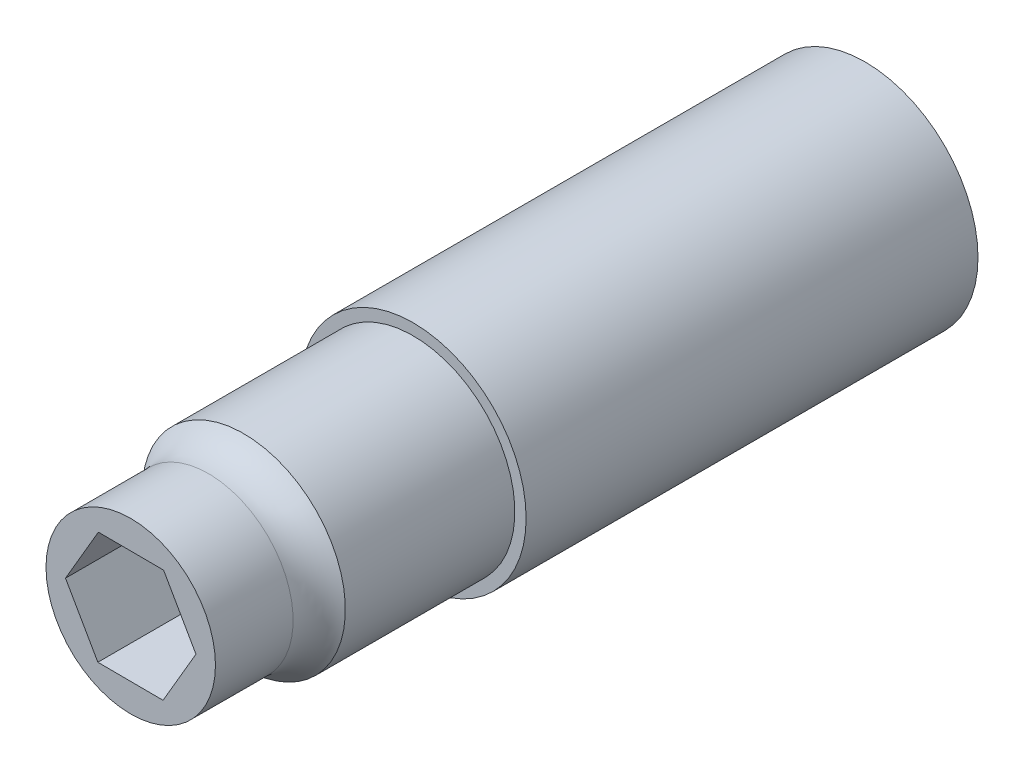
ISO-10303-21;
HEADER;
FILE_DESCRIPTION(('STEP AP214'),'2;1');
FILE_NAME('part.step','',(''),(''),'','','');
FILE_SCHEMA(('AUTOMOTIVE_DESIGN { 1 0 10303 214 1 1 1 1 }'));
ENDSEC;
DATA;
#1=APPLICATION_CONTEXT('core data for automotive mechanical design processes');
#2=APPLICATION_PROTOCOL_DEFINITION('international standard','automotive_design',2000,#1);
#3=PRODUCT_CONTEXT('',#1,'mechanical');
#4=PRODUCT('Part','Part','',(#3));
#5=PRODUCT_RELATED_PRODUCT_CATEGORY('part','',(#4));
#6=PRODUCT_DEFINITION_FORMATION('','',#4);
#7=PRODUCT_DEFINITION_CONTEXT('part definition',#1,'design');
#8=PRODUCT_DEFINITION('design','',#6,#7);
#9=PRODUCT_DEFINITION_SHAPE('','',#8);
#10=(LENGTH_UNIT() NAMED_UNIT(*) SI_UNIT(.MILLI.,.METRE.));
#11=(NAMED_UNIT(*) PLANE_ANGLE_UNIT() SI_UNIT($,.RADIAN.));
#12=(NAMED_UNIT(*) SI_UNIT($,.STERADIAN.) SOLID_ANGLE_UNIT());
#13=UNCERTAINTY_MEASURE_WITH_UNIT(LENGTH_MEASURE(1.E-05),#10,'distance_accuracy_value','');
#14=(GEOMETRIC_REPRESENTATION_CONTEXT(3) GLOBAL_UNCERTAINTY_ASSIGNED_CONTEXT((#13)) GLOBAL_UNIT_ASSIGNED_CONTEXT((#10,
#11,#12)) REPRESENTATION_CONTEXT('',''));
#15=CARTESIAN_POINT('',(0.,0.,0.));
#16=DIRECTION('',(0.,0.,1.));
#17=DIRECTION('',(1.,0.,0.));
#18=AXIS2_PLACEMENT_3D('',#15,#16,#17);
#19=CARTESIAN_POINT('',(0.,0.,50.8));
#20=DIRECTION('',(0.,0.,-1.));
#21=DIRECTION('',(-1.,0.,0.));
#22=AXIS2_PLACEMENT_3D('',#19,#20,#21);
#23=CYLINDRICAL_SURFACE('',#22,12.7);
#24=CARTESIAN_POINT('',(0.,0.,50.8));
#25=DIRECTION('',(0.,0.,1.));
#26=DIRECTION('',(1.,0.,0.));
#27=AXIS2_PLACEMENT_3D('',#24,#25,#26);
#28=CIRCLE('',#27,12.7);
#29=CARTESIAN_POINT('',(12.7,0.,50.8));
#30=VERTEX_POINT('',#29);
#31=EDGE_CURVE('E149',#30,#30,#28,.T.);
#32=ORIENTED_EDGE('',*,*,#31,.F.);
#33=EDGE_LOOP('',(#32));
#34=FACE_BOUND('',#33,.T.);
#35=CARTESIAN_POINT('',(0.,0.,0.));
#36=DIRECTION('',(0.,0.,1.));
#37=DIRECTION('',(1.,0.,0.));
#38=AXIS2_PLACEMENT_3D('',#35,#36,#37);
#39=CIRCLE('',#38,12.7);
#40=CARTESIAN_POINT('',(12.7,0.,0.));
#41=VERTEX_POINT('',#40);
#42=EDGE_CURVE('E146',#41,#41,#39,.T.);
#43=ORIENTED_EDGE('',*,*,#42,.T.);
#44=EDGE_LOOP('',(#43));
#45=FACE_BOUND('',#44,.T.);
#46=ADVANCED_FACE('F33',(#34,#45),#23,.T.);
#47=CARTESIAN_POINT('',(0.,0.,50.8));
#48=DIRECTION('',(0.,0.,1.));
#49=DIRECTION('',(1.,0.,0.));
#50=AXIS2_PLACEMENT_3D('',#47,#48,#49);
#51=PLANE('',#50);
#52=CARTESIAN_POINT('',(0.,0.,50.8));
#53=DIRECTION('',(0.,0.,1.));
#54=DIRECTION('',(1.,0.,0.));
#55=AXIS2_PLACEMENT_3D('',#52,#53,#54);
#56=CIRCLE('',#55,11.43);
#57=CARTESIAN_POINT('',(-11.43,0.,50.8));
#58=VERTEX_POINT('',#57);
#59=EDGE_CURVE('E41',#58,#58,#56,.T.);
#60=ORIENTED_EDGE('',*,*,#59,.F.);
#61=EDGE_LOOP('',(#60));
#62=FACE_BOUND('',#61,.T.);
#63=ORIENTED_EDGE('',*,*,#31,.T.);
#64=EDGE_LOOP('',(#63));
#65=FACE_BOUND('',#64,.T.);
#66=ADVANCED_FACE('F158',(#62,#65),#51,.T.);
#67=CARTESIAN_POINT('',(0.,0.,0.));
#68=DIRECTION('',(0.,0.,1.));
#69=DIRECTION('',(1.,0.,0.));
#70=AXIS2_PLACEMENT_3D('',#67,#68,#69);
#71=PLANE('',#70);
#72=ORIENTED_EDGE('',*,*,#42,.F.);
#73=EDGE_LOOP('',(#72));
#74=FACE_BOUND('',#73,.T.);
#75=ADVANCED_FACE('F155',(#74),#71,.F.);
#76=CARTESIAN_POINT('',(0.,0.,69.85));
#77=DIRECTION('',(0.,0.,-1.));
#78=DIRECTION('',(-1.,0.,0.));
#79=AXIS2_PLACEMENT_3D('',#76,#77,#78);
#80=CYLINDRICAL_SURFACE('',#79,11.43);
#81=CARTESIAN_POINT('',(0.,0.,69.85));
#82=DIRECTION('',(0.,0.,1.));
#83=DIRECTION('',(1.,0.,0.));
#84=AXIS2_PLACEMENT_3D('',#81,#82,#83);
#85=CIRCLE('',#84,11.43);
#86=CARTESIAN_POINT('',(-11.43,0.,69.85));
#87=VERTEX_POINT('',#86);
#88=EDGE_CURVE('E143',#87,#87,#85,.T.);
#89=CARTESIAN_POINT('',(-11.43,0.,69.85));
#90=CARTESIAN_POINT('',(-11.43,0.,69.6515625));
#91=CARTESIAN_POINT('',(-11.43,0.,69.453125));
#92=CARTESIAN_POINT('',(-11.43,0.,69.05625));
#93=CARTESIAN_POINT('',(-11.43,0.,68.8578125));
#94=CARTESIAN_POINT('',(-11.43,0.,68.4609375));
#95=CARTESIAN_POINT('',(-11.43,0.,68.2625));
#96=CARTESIAN_POINT('',(-11.43,0.,67.865625));
#97=CARTESIAN_POINT('',(-11.43,0.,67.6671875));
#98=CARTESIAN_POINT('',(-11.43,0.,67.2703125));
#99=CARTESIAN_POINT('',(-11.43,0.,67.071875));
#100=CARTESIAN_POINT('',(-11.43,0.,66.675));
#101=CARTESIAN_POINT('',(-11.43,0.,66.4765625));
#102=CARTESIAN_POINT('',(-11.43,0.,66.0796875));
#103=CARTESIAN_POINT('',(-11.43,0.,65.88125));
#104=CARTESIAN_POINT('',(-11.43,0.,65.484375));
#105=CARTESIAN_POINT('',(-11.43,0.,65.2859375));
#106=CARTESIAN_POINT('',(-11.43,0.,64.8890625));
#107=CARTESIAN_POINT('',(-11.43,0.,64.690625));
#108=CARTESIAN_POINT('',(-11.43,0.,64.29375));
#109=CARTESIAN_POINT('',(-11.43,0.,64.0953125));
#110=CARTESIAN_POINT('',(-11.43,0.,63.6984375));
#111=CARTESIAN_POINT('',(-11.43,0.,63.5));
#112=CARTESIAN_POINT('',(-11.43,0.,63.103125));
#113=CARTESIAN_POINT('',(-11.43,0.,62.9046875));
#114=CARTESIAN_POINT('',(-11.43,0.,62.5078125));
#115=CARTESIAN_POINT('',(-11.43,0.,62.309375));
#116=CARTESIAN_POINT('',(-11.43,0.,61.9125));
#117=CARTESIAN_POINT('',(-11.43,0.,61.7140625));
#118=CARTESIAN_POINT('',(-11.43,0.,61.3171875));
#119=CARTESIAN_POINT('',(-11.43,0.,61.11875));
#120=CARTESIAN_POINT('',(-11.43,0.,60.721875));
#121=CARTESIAN_POINT('',(-11.43,0.,60.5234375));
#122=CARTESIAN_POINT('',(-11.43,0.,60.1265625));
#123=CARTESIAN_POINT('',(-11.43,0.,59.928125));
#124=CARTESIAN_POINT('',(-11.43,0.,59.53125));
#125=CARTESIAN_POINT('',(-11.43,0.,59.3328125));
#126=CARTESIAN_POINT('',(-11.43,0.,58.9359375));
#127=CARTESIAN_POINT('',(-11.43,0.,58.7375));
#128=CARTESIAN_POINT('',(-11.43,0.,58.340625));
#129=CARTESIAN_POINT('',(-11.43,0.,58.1421875));
#130=CARTESIAN_POINT('',(-11.43,0.,57.7453125));
#131=CARTESIAN_POINT('',(-11.43,0.,57.546875));
#132=CARTESIAN_POINT('',(-11.43,0.,57.15));
#133=CARTESIAN_POINT('',(-11.43,0.,56.9515625));
#134=CARTESIAN_POINT('',(-11.43,0.,56.5546875));
#135=CARTESIAN_POINT('',(-11.43,0.,56.35625));
#136=CARTESIAN_POINT('',(-11.43,0.,55.959375));
#137=CARTESIAN_POINT('',(-11.43,0.,55.7609375));
#138=CARTESIAN_POINT('',(-11.43,0.,55.3640625));
#139=CARTESIAN_POINT('',(-11.43,0.,55.165625));
#140=CARTESIAN_POINT('',(-11.43,0.,54.76875));
#141=CARTESIAN_POINT('',(-11.43,0.,54.5703125));
#142=CARTESIAN_POINT('',(-11.43,0.,54.1734375));
#143=CARTESIAN_POINT('',(-11.43,0.,53.975));
#144=CARTESIAN_POINT('',(-11.43,0.,53.578125));
#145=CARTESIAN_POINT('',(-11.43,0.,53.3796875));
#146=CARTESIAN_POINT('',(-11.43,0.,52.9828125));
#147=CARTESIAN_POINT('',(-11.43,0.,52.784375));
#148=CARTESIAN_POINT('',(-11.43,0.,52.3875));
#149=CARTESIAN_POINT('',(-11.43,0.,52.1890625));
#150=CARTESIAN_POINT('',(-11.43,0.,51.7921875));
#151=CARTESIAN_POINT('',(-11.43,0.,51.59375));
#152=CARTESIAN_POINT('',(-11.43,0.,51.196875));
#153=CARTESIAN_POINT('',(-11.43,0.,50.9984375));
#154=CARTESIAN_POINT('',(-11.43,0.,50.8));
#155=B_SPLINE_CURVE_WITH_KNOTS('',3,(#89,#90,#91,#92,#93,#94,#95,#96,#97,#98,#99,#100,#101,#102,
#103,#104,#105,#106,#107,#108,#109,#110,#111,#112,#113,#114,#115,#116,#117,#118,#119,#120,#121,
#122,#123,#124,#125,#126,#127,#128,#129,#130,#131,#132,#133,#134,#135,#136,#137,#138,#139,#140,
#141,#142,#143,#144,#145,#146,#147,#148,#149,#150,#151,#152,#153,#154),.UNSPECIFIED.,.F.,.F.,(4,
2,2,2,2,2,2,2,2,2,2,2,2,2,2,2,2,2,2,2,2,2,2,2,2,2,2,2,2,2,2,2,4),(0.,0.5953125,1.190625,
1.7859375,2.38125,2.9765625,3.571875,4.1671875,4.7625,5.3578125,5.953125,6.5484375,7.14375,
7.7390625,8.334375,8.92968750000001,9.52500000000001,10.1203125,10.715625,11.3109375,11.90625,
12.5015625,13.096875,13.6921875,14.2875,14.8828125,15.478125,16.0734375,16.66875,17.2640625,
17.859375,18.4546875,19.05),.UNSPECIFIED.);
#156=EDGE_CURVE('BSEAM157',#87,#58,#155,.T.);
#157=ORIENTED_EDGE('',*,*,#88,.F.);
#158=ORIENTED_EDGE('',*,*,#59,.T.);
#159=ORIENTED_EDGE('',*,*,#156,.T.);
#160=ORIENTED_EDGE('',*,*,#156,.F.);
#161=EDGE_LOOP('',(#157,#159,#158,#160));
#162=FACE_BOUND('',#161,.T.);
#163=ADVANCED_FACE('F157',(#162),#80,.T.);
#164=CARTESIAN_POINT('',(0.,0.,82.55));
#165=DIRECTION('',(0.,0.,-1.));
#166=DIRECTION('',(-1.,0.,0.));
#167=AXIS2_PLACEMENT_3D('',#164,#165,#166);
#168=CYLINDRICAL_SURFACE('',#167,9.525);
#169=CARTESIAN_POINT('',(0.,0.,73.815573728983));
#170=DIRECTION('',(0.,0.,-1.));
#171=DIRECTION('',(-1.,0.,0.));
#172=AXIS2_PLACEMENT_3D('',#169,#170,#171);
#173=CIRCLE('',#172,9.525);
#174=CARTESIAN_POINT('',(-9.525,0.,73.815573728983));
#175=VERTEX_POINT('',#174);
#176=EDGE_CURVE('E11',#175,#175,#173,.F.);
#177=ORIENTED_EDGE('',*,*,#176,.T.);
#178=EDGE_LOOP('',(#177));
#179=FACE_BOUND('',#178,.T.);
#180=CARTESIAN_POINT('',(0.,0.,82.55));
#181=DIRECTION('',(0.,0.,1.));
#182=DIRECTION('',(1.,0.,0.));
#183=AXIS2_PLACEMENT_3D('',#180,#181,#182);
#184=CIRCLE('',#183,9.525);
#185=CARTESIAN_POINT('',(9.525,0.,82.55));
#186=VERTEX_POINT('',#185);
#187=EDGE_CURVE('E135',#186,#186,#184,.T.);
#188=ORIENTED_EDGE('',*,*,#187,.F.);
#189=EDGE_LOOP('',(#188));
#190=FACE_BOUND('',#189,.T.);
#191=ADVANCED_FACE('F164',(#179,#190),#168,.T.);
#192=CARTESIAN_POINT('',(0.,0.,82.55));
#193=DIRECTION('',(0.,0.,1.));
#194=DIRECTION('',(1.,0.,0.));
#195=AXIS2_PLACEMENT_3D('',#192,#193,#194);
#196=PLANE('',#195);
#197=DIRECTION('',(-0.49564129592218,0.868527320109495,0.));
#198=VECTOR('',#197,1.);
#199=CARTESIAN_POINT('',(7.33225581889605,-0.0368502319990447,82.55));
#200=LINE('',#199,#198);
#201=CARTESIAN_POINT('',(7.33225581889605,-0.0368502319990447,82.55));
#202=VERTEX_POINT('',#201);
#203=CARTESIAN_POINT('',(3.69804114649454,6.33149469021073,82.55));
#204=VERTEX_POINT('',#203);
#205=EDGE_CURVE('E48',#202,#204,#200,.T.);
#206=ORIENTED_EDGE('',*,*,#205,.F.);
#207=DIRECTION('',(0.504346075134552,0.863501613487996,0.));
#208=VECTOR('',#207,1.);
#209=CARTESIAN_POINT('',(3.63421467240151,-6.36834492220977,82.55));
#210=LINE('',#209,#208);
#211=CARTESIAN_POINT('',(3.63421467240151,-6.36834492220977,82.55));
#212=VERTEX_POINT('',#211);
#213=EDGE_CURVE('E131',#212,#202,#210,.T.);
#214=ORIENTED_EDGE('',*,*,#213,.F.);
#215=DIRECTION('',(0.999987371056732,-0.0050257066214992,0.));
#216=VECTOR('',#215,1.);
#217=CARTESIAN_POINT('',(-3.69804114649454,-6.33149469021073,82.55));
#218=LINE('',#217,#216);
#219=CARTESIAN_POINT('',(-3.69804114649454,-6.33149469021073,82.55));
#220=VERTEX_POINT('',#219);
#221=EDGE_CURVE('E129',#220,#212,#218,.T.);
#222=ORIENTED_EDGE('',*,*,#221,.F.);
#223=DIRECTION('',(0.49564129592218,-0.868527320109495,0.));
#224=VECTOR('',#223,1.);
#225=CARTESIAN_POINT('',(-7.33225581889605,0.036850231999043,82.55));
#226=LINE('',#225,#224);
#227=CARTESIAN_POINT('',(-7.33225581889605,0.036850231999043,82.55));
#228=VERTEX_POINT('',#227);
#229=EDGE_CURVE('E96',#228,#220,#226,.T.);
#230=ORIENTED_EDGE('',*,*,#229,.F.);
#231=DIRECTION('',(-0.504346075134552,-0.863501613487996,0.));
#232=VECTOR('',#231,1.);
#233=CARTESIAN_POINT('',(-3.6342146724015,6.36834492220977,82.55));
#234=LINE('',#233,#232);
#235=CARTESIAN_POINT('',(-3.6342146724015,6.36834492220977,82.55));
#236=VERTEX_POINT('',#235);
#237=EDGE_CURVE('E125',#236,#228,#234,.T.);
#238=ORIENTED_EDGE('',*,*,#237,.F.);
#239=DIRECTION('',(-0.999987371056732,0.0050257066214992,0.));
#240=VECTOR('',#239,1.);
#241=CARTESIAN_POINT('',(3.69804114649454,6.33149469021073,82.55));
#242=LINE('',#241,#240);
#243=EDGE_CURVE('E122',#204,#236,#242,.T.);
#244=ORIENTED_EDGE('',*,*,#243,.F.);
#245=EDGE_LOOP('',(#206,#214,#222,#230,#238,#244));
#246=FACE_BOUND('',#245,.T.);
#247=ORIENTED_EDGE('',*,*,#187,.T.);
#248=EDGE_LOOP('',(#247));
#249=FACE_BOUND('',#248,.T.);
#250=ADVANCED_FACE('F196',(#246,#249),#196,.T.);
#251=CARTESIAN_POINT('',(0.,0.,73.815573728983));
#252=DIRECTION('',(0.,0.,-1.));
#253=DIRECTION('',(-1.,0.,0.));
#254=AXIS2_PLACEMENT_3D('',#251,#252,#253);
#255=TOROIDAL_SURFACE('',#254,14.605,5.08);
#256=ORIENTED_EDGE('',*,*,#88,.T.);
#257=EDGE_LOOP('',(#256));
#258=FACE_BOUND('',#257,.T.);
#259=ORIENTED_EDGE('',*,*,#176,.F.);
#260=EDGE_LOOP('',(#259));
#261=FACE_BOUND('',#260,.T.);
#262=ADVANCED_FACE('F35',(#258,#261),#255,.F.);
#263=CARTESIAN_POINT('',(7.33225581889605,-0.0368502319990447,73.025));
#264=DIRECTION('',(0.868527320109495,0.49564129592218,0.));
#265=DIRECTION('',(-0.49564129592218,0.868527320109496,0.));
#266=AXIS2_PLACEMENT_3D('',#263,#264,#265);
#267=PLANE('',#266);
#268=ORIENTED_EDGE('',*,*,#205,.T.);
#269=DIRECTION('',(0.,0.,1.));
#270=VECTOR('',#269,1.);
#271=CARTESIAN_POINT('',(3.69804114649454,6.33149469021073,73.025));
#272=LINE('',#271,#270);
#273=CARTESIAN_POINT('',(3.69804114649454,6.33149469021073,73.025));
#274=VERTEX_POINT('',#273);
#275=EDGE_CURVE('E78',#274,#204,#272,.T.);
#276=ORIENTED_EDGE('',*,*,#275,.F.);
#277=DIRECTION('',(-0.49564129592218,0.868527320109495,0.));
#278=VECTOR('',#277,1.);
#279=CARTESIAN_POINT('',(7.33225581889605,-0.0368502319990447,73.025));
#280=LINE('',#279,#278);
#281=CARTESIAN_POINT('',(7.33225581889605,-0.0368502319990447,73.025));
#282=VERTEX_POINT('',#281);
#283=EDGE_CURVE('E133',#282,#274,#280,.T.);
#284=ORIENTED_EDGE('',*,*,#283,.F.);
#285=DIRECTION('',(0.,0.,1.));
#286=VECTOR('',#285,1.);
#287=CARTESIAN_POINT('',(7.33225581889605,-0.0368502319990447,73.025));
#288=LINE('',#287,#286);
#289=EDGE_CURVE('E56',#282,#202,#288,.T.);
#290=ORIENTED_EDGE('',*,*,#289,.T.);
#291=EDGE_LOOP('',(#268,#276,#284,#290));
#292=FACE_BOUND('',#291,.T.);
#293=ADVANCED_FACE('F208',(#292),#267,.F.);
#294=CARTESIAN_POINT('',(3.63421467240151,-6.36834492220977,73.025));
#295=DIRECTION('',(0.863501613487996,-0.504346075134552,0.));
#296=DIRECTION('',(0.504346075134552,0.863501613487996,0.));
#297=AXIS2_PLACEMENT_3D('',#294,#295,#296);
#298=PLANE('',#297);
#299=ORIENTED_EDGE('',*,*,#213,.T.);
#300=ORIENTED_EDGE('',*,*,#289,.F.);
#301=DIRECTION('',(0.504346075134552,0.863501613487996,0.));
#302=VECTOR('',#301,1.);
#303=CARTESIAN_POINT('',(3.63421467240151,-6.36834492220977,73.025));
#304=LINE('',#303,#302);
#305=CARTESIAN_POINT('',(3.63421467240151,-6.36834492220977,73.025));
#306=VERTEX_POINT('',#305);
#307=EDGE_CURVE('E108',#306,#282,#304,.T.);
#308=ORIENTED_EDGE('',*,*,#307,.F.);
#309=DIRECTION('',(0.,0.,1.));
#310=VECTOR('',#309,1.);
#311=CARTESIAN_POINT('',(3.63421467240151,-6.36834492220977,73.025));
#312=LINE('',#311,#310);
#313=EDGE_CURVE('E100',#306,#212,#312,.T.);
#314=ORIENTED_EDGE('',*,*,#313,.T.);
#315=EDGE_LOOP('',(#299,#300,#308,#314));
#316=FACE_BOUND('',#315,.T.);
#317=ADVANCED_FACE('F224',(#316),#298,.F.);
#318=CARTESIAN_POINT('',(-3.69804114649454,-6.33149469021073,73.025));
#319=DIRECTION('',(-0.0050257066214992,-0.999987371056732,0.));
#320=DIRECTION('',(0.999987371056732,-0.0050257066214992,0.));
#321=AXIS2_PLACEMENT_3D('',#318,#319,#320);
#322=PLANE('',#321);
#323=ORIENTED_EDGE('',*,*,#221,.T.);
#324=ORIENTED_EDGE('',*,*,#313,.F.);
#325=DIRECTION('',(0.999987371056732,-0.0050257066214992,0.));
#326=VECTOR('',#325,1.);
#327=CARTESIAN_POINT('',(-3.69804114649454,-6.33149469021073,73.025));
#328=LINE('',#327,#326);
#329=CARTESIAN_POINT('',(-3.69804114649454,-6.33149469021073,73.025));
#330=VERTEX_POINT('',#329);
#331=EDGE_CURVE('E104',#330,#306,#328,.T.);
#332=ORIENTED_EDGE('',*,*,#331,.F.);
#333=DIRECTION('',(0.,0.,1.));
#334=VECTOR('',#333,1.);
#335=CARTESIAN_POINT('',(-3.69804114649454,-6.33149469021073,73.025));
#336=LINE('',#335,#334);
#337=EDGE_CURVE('E89',#330,#220,#336,.T.);
#338=ORIENTED_EDGE('',*,*,#337,.T.);
#339=EDGE_LOOP('',(#323,#324,#332,#338));
#340=FACE_BOUND('',#339,.T.);
#341=ADVANCED_FACE('F105',(#340),#322,.F.);
#342=CARTESIAN_POINT('',(-7.33225581889605,0.036850231999043,73.025));
#343=DIRECTION('',(-0.868527320109495,-0.49564129592218,0.));
#344=DIRECTION('',(0.49564129592218,-0.868527320109496,0.));
#345=AXIS2_PLACEMENT_3D('',#342,#343,#344);
#346=PLANE('',#345);
#347=ORIENTED_EDGE('',*,*,#229,.T.);
#348=ORIENTED_EDGE('',*,*,#337,.F.);
#349=DIRECTION('',(0.49564129592218,-0.868527320109495,0.));
#350=VECTOR('',#349,1.);
#351=CARTESIAN_POINT('',(-7.33225581889605,0.036850231999043,73.025));
#352=LINE('',#351,#350);
#353=CARTESIAN_POINT('',(-7.33225581889605,0.036850231999043,73.025));
#354=VERTEX_POINT('',#353);
#355=EDGE_CURVE('E93',#354,#330,#352,.T.);
#356=ORIENTED_EDGE('',*,*,#355,.F.);
#357=DIRECTION('',(0.,0.,1.));
#358=VECTOR('',#357,1.);
#359=CARTESIAN_POINT('',(-7.33225581889605,0.036850231999043,73.025));
#360=LINE('',#359,#358);
#361=EDGE_CURVE('E101',#354,#228,#360,.T.);
#362=ORIENTED_EDGE('',*,*,#361,.T.);
#363=EDGE_LOOP('',(#347,#348,#356,#362));
#364=FACE_BOUND('',#363,.T.);
#365=ADVANCED_FACE('F91',(#364),#346,.F.);
#366=CARTESIAN_POINT('',(-3.6342146724015,6.36834492220977,73.025));
#367=DIRECTION('',(-0.863501613487996,0.504346075134552,0.));
#368=DIRECTION('',(-0.504346075134552,-0.863501613487996,0.));
#369=AXIS2_PLACEMENT_3D('',#366,#367,#368);
#370=PLANE('',#369);
#371=ORIENTED_EDGE('',*,*,#237,.T.);
#372=ORIENTED_EDGE('',*,*,#361,.F.);
#373=DIRECTION('',(-0.504346075134552,-0.863501613487996,0.));
#374=VECTOR('',#373,1.);
#375=CARTESIAN_POINT('',(-3.6342146724015,6.36834492220977,73.025));
#376=LINE('',#375,#374);
#377=CARTESIAN_POINT('',(-3.6342146724015,6.36834492220977,73.025));
#378=VERTEX_POINT('',#377);
#379=EDGE_CURVE('E114',#378,#354,#376,.T.);
#380=ORIENTED_EDGE('',*,*,#379,.F.);
#381=DIRECTION('',(0.,0.,1.));
#382=VECTOR('',#381,1.);
#383=CARTESIAN_POINT('',(-3.6342146724015,6.36834492220977,73.025));
#384=LINE('',#383,#382);
#385=EDGE_CURVE('E138',#378,#236,#384,.T.);
#386=ORIENTED_EDGE('',*,*,#385,.T.);
#387=EDGE_LOOP('',(#371,#372,#380,#386));
#388=FACE_BOUND('',#387,.T.);
#389=ADVANCED_FACE('F249',(#388),#370,.F.);
#390=CARTESIAN_POINT('',(3.69804114649454,6.33149469021073,73.025));
#391=DIRECTION('',(0.0050257066214992,0.999987371056732,0.));
#392=DIRECTION('',(-0.999987371056732,0.0050257066214992,0.));
#393=AXIS2_PLACEMENT_3D('',#390,#391,#392);
#394=PLANE('',#393);
#395=ORIENTED_EDGE('',*,*,#243,.T.);
#396=ORIENTED_EDGE('',*,*,#385,.F.);
#397=DIRECTION('',(-0.999987371056732,0.0050257066214992,0.));
#398=VECTOR('',#397,1.);
#399=CARTESIAN_POINT('',(3.69804114649454,6.33149469021073,73.025));
#400=LINE('',#399,#398);
#401=EDGE_CURVE('E116',#274,#378,#400,.T.);
#402=ORIENTED_EDGE('',*,*,#401,.F.);
#403=ORIENTED_EDGE('',*,*,#275,.T.);
#404=EDGE_LOOP('',(#395,#396,#402,#403));
#405=FACE_BOUND('',#404,.T.);
#406=ADVANCED_FACE('F258',(#405),#394,.F.);
#407=CARTESIAN_POINT('',(0.,0.,73.025));
#408=DIRECTION('',(0.,0.,1.));
#409=DIRECTION('',(1.,0.,0.));
#410=AXIS2_PLACEMENT_3D('',#407,#408,#409);
#411=PLANE('',#410);
#412=ORIENTED_EDGE('',*,*,#283,.T.);
#413=ORIENTED_EDGE('',*,*,#401,.T.);
#414=ORIENTED_EDGE('',*,*,#379,.T.);
#415=ORIENTED_EDGE('',*,*,#355,.T.);
#416=ORIENTED_EDGE('',*,*,#331,.T.);
#417=ORIENTED_EDGE('',*,*,#307,.T.);
#418=EDGE_LOOP('',(#412,#413,#414,#415,#416,#417));
#419=FACE_BOUND('',#418,.T.);
#420=ADVANCED_FACE('F111',(#419),#411,.T.);
#421=CLOSED_SHELL('',(#46,#66,#75,#163,#191,#250,#262,#293,#317,#341,#365,#389,#406,#420));
#422=MANIFOLD_SOLID_BREP('B2',#421);
#423=ADVANCED_BREP_SHAPE_REPRESENTATION('',(#18,#422),#14);
#424=SHAPE_DEFINITION_REPRESENTATION(#9,#423);
ENDSEC;
END-ISO-10303-21;
